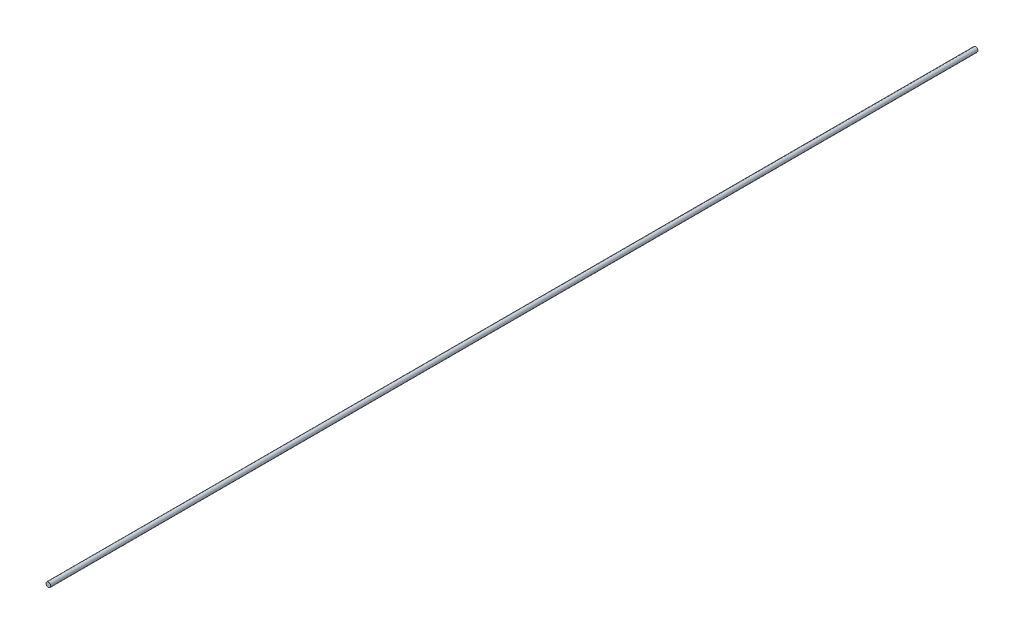
ISO-10303-21;
HEADER;
FILE_DESCRIPTION(('STEP AP214'),'2;1');
FILE_NAME('part.step','',(''),(''),'','','');
FILE_SCHEMA(('AUTOMOTIVE_DESIGN { 1 0 10303 214 1 1 1 1 }'));
ENDSEC;
DATA;
#1=APPLICATION_CONTEXT('core data for automotive mechanical design processes');
#2=APPLICATION_PROTOCOL_DEFINITION('international standard','automotive_design',2000,#1);
#3=PRODUCT_CONTEXT('',#1,'mechanical');
#4=PRODUCT('Part','Part','',(#3));
#5=PRODUCT_RELATED_PRODUCT_CATEGORY('part','',(#4));
#6=PRODUCT_DEFINITION_FORMATION('','',#4);
#7=PRODUCT_DEFINITION_CONTEXT('part definition',#1,'design');
#8=PRODUCT_DEFINITION('design','',#6,#7);
#9=PRODUCT_DEFINITION_SHAPE('','',#8);
#10=(LENGTH_UNIT() NAMED_UNIT(*) SI_UNIT(.MILLI.,.METRE.));
#11=(NAMED_UNIT(*) PLANE_ANGLE_UNIT() SI_UNIT($,.RADIAN.));
#12=(NAMED_UNIT(*) SI_UNIT($,.STERADIAN.) SOLID_ANGLE_UNIT());
#13=UNCERTAINTY_MEASURE_WITH_UNIT(LENGTH_MEASURE(1.E-05),#10,'distance_accuracy_value','');
#14=(GEOMETRIC_REPRESENTATION_CONTEXT(3) GLOBAL_UNCERTAINTY_ASSIGNED_CONTEXT((#13)) GLOBAL_UNIT_ASSIGNED_CONTEXT((#10,
#11,#12)) REPRESENTATION_CONTEXT('',''));
#15=CARTESIAN_POINT('',(0.,0.,0.));
#16=DIRECTION('',(0.,0.,1.));
#17=DIRECTION('',(1.,0.,0.));
#18=AXIS2_PLACEMENT_3D('',#15,#16,#17);
#19=CARTESIAN_POINT('',(0.,0.,1980.));
#20=DIRECTION('',(0.,0.,-1.));
#21=DIRECTION('',(-1.,0.,0.));
#22=AXIS2_PLACEMENT_3D('',#19,#20,#21);
#23=CYLINDRICAL_SURFACE('',#22,5.);
#24=CARTESIAN_POINT('',(0.,0.,1980.));
#25=DIRECTION('',(0.,0.,1.));
#26=DIRECTION('',(1.,0.,0.));
#27=AXIS2_PLACEMENT_3D('',#24,#25,#26);
#28=CIRCLE('',#27,5.);
#29=CARTESIAN_POINT('',(5.,0.,1980.));
#30=VERTEX_POINT('',#29);
#31=EDGE_CURVE('E10',#30,#30,#28,.T.);
#32=ORIENTED_EDGE('',*,*,#31,.F.);
#33=EDGE_LOOP('',(#32));
#34=FACE_BOUND('',#33,.T.);
#35=CARTESIAN_POINT('',(0.,0.,0.));
#36=DIRECTION('',(0.,0.,1.));
#37=DIRECTION('',(1.,0.,0.));
#38=AXIS2_PLACEMENT_3D('',#35,#36,#37);
#39=CIRCLE('',#38,5.);
#40=CARTESIAN_POINT('',(5.,0.,0.));
#41=VERTEX_POINT('',#40);
#42=EDGE_CURVE('E34',#41,#41,#39,.T.);
#43=ORIENTED_EDGE('',*,*,#42,.T.);
#44=EDGE_LOOP('',(#43));
#45=FACE_BOUND('',#44,.T.);
#46=ADVANCED_FACE('F31',(#34,#45),#23,.T.);
#47=CARTESIAN_POINT('',(0.,0.,1980.));
#48=DIRECTION('',(0.,0.,1.));
#49=DIRECTION('',(1.,0.,0.));
#50=AXIS2_PLACEMENT_3D('',#47,#48,#49);
#51=PLANE('',#50);
#52=ORIENTED_EDGE('',*,*,#31,.T.);
#53=EDGE_LOOP('',(#52));
#54=FACE_BOUND('',#53,.T.);
#55=ADVANCED_FACE('F46',(#54),#51,.T.);
#56=CARTESIAN_POINT('',(0.,0.,0.));
#57=DIRECTION('',(0.,0.,1.));
#58=DIRECTION('',(1.,0.,0.));
#59=AXIS2_PLACEMENT_3D('',#56,#57,#58);
#60=PLANE('',#59);
#61=ORIENTED_EDGE('',*,*,#42,.F.);
#62=EDGE_LOOP('',(#61));
#63=FACE_BOUND('',#62,.T.);
#64=ADVANCED_FACE('F44',(#63),#60,.F.);
#65=CLOSED_SHELL('',(#46,#55,#64));
#66=MANIFOLD_SOLID_BREP('B2',#65);
#67=ADVANCED_BREP_SHAPE_REPRESENTATION('',(#18,#66),#14);
#68=SHAPE_DEFINITION_REPRESENTATION(#9,#67);
ENDSEC;
END-ISO-10303-21;
